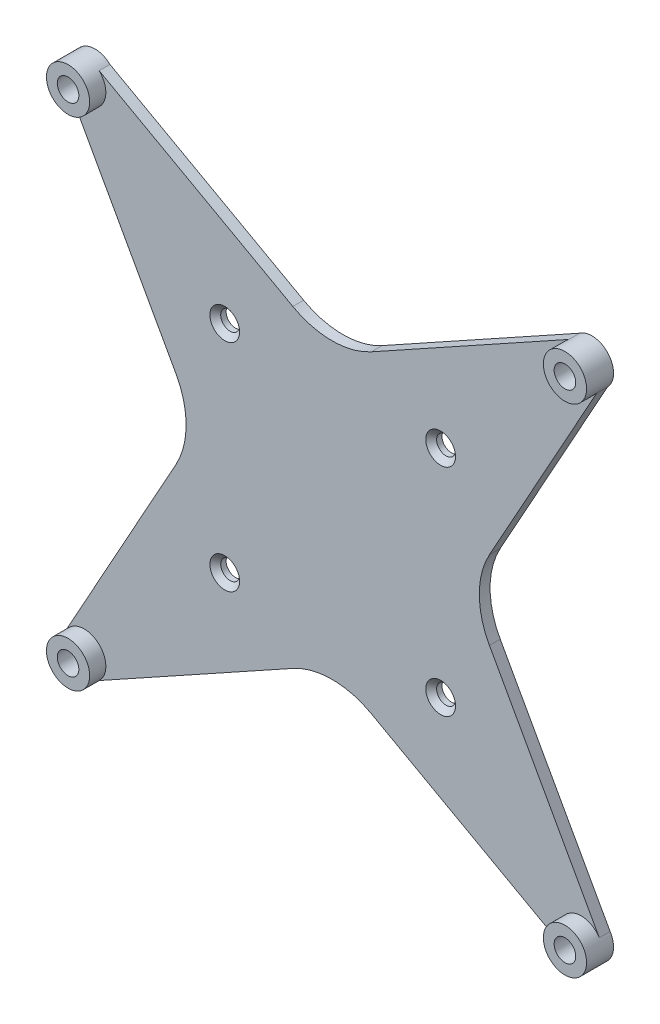
ISO-10303-21;
HEADER;
FILE_DESCRIPTION(('STEP AP214'),'2;1');
FILE_NAME('part.step','',(''),(''),'','','');
FILE_SCHEMA(('AUTOMOTIVE_DESIGN { 1 0 10303 214 1 1 1 1 }'));
ENDSEC;
DATA;
#1=APPLICATION_CONTEXT('core data for automotive mechanical design processes');
#2=APPLICATION_PROTOCOL_DEFINITION('international standard','automotive_design',2000,#1);
#3=PRODUCT_CONTEXT('',#1,'mechanical');
#4=PRODUCT('Part','Part','',(#3));
#5=PRODUCT_RELATED_PRODUCT_CATEGORY('part','',(#4));
#6=PRODUCT_DEFINITION_FORMATION('','',#4);
#7=PRODUCT_DEFINITION_CONTEXT('part definition',#1,'design');
#8=PRODUCT_DEFINITION('design','',#6,#7);
#9=PRODUCT_DEFINITION_SHAPE('','',#8);
#10=(LENGTH_UNIT() NAMED_UNIT(*) SI_UNIT(.MILLI.,.METRE.));
#11=(NAMED_UNIT(*) PLANE_ANGLE_UNIT() SI_UNIT($,.RADIAN.));
#12=(NAMED_UNIT(*) SI_UNIT($,.STERADIAN.) SOLID_ANGLE_UNIT());
#13=UNCERTAINTY_MEASURE_WITH_UNIT(LENGTH_MEASURE(1.E-05),#10,'distance_accuracy_value','');
#14=(GEOMETRIC_REPRESENTATION_CONTEXT(3) GLOBAL_UNCERTAINTY_ASSIGNED_CONTEXT((#13)) GLOBAL_UNIT_ASSIGNED_CONTEXT((#10,
#11,#12)) REPRESENTATION_CONTEXT('',''));
#15=CARTESIAN_POINT('',(0.,0.,0.));
#16=DIRECTION('',(0.,0.,1.));
#17=DIRECTION('',(1.,0.,0.));
#18=AXIS2_PLACEMENT_3D('',#15,#16,#17);
#19=CARTESIAN_POINT('',(136.15454301431,230.793193515127,178.407141652104));
#20=DIRECTION('',(0.,0.,1.));
#21=DIRECTION('',(1.,0.,0.));
#22=AXIS2_PLACEMENT_3D('',#19,#20,#21);
#23=CYLINDRICAL_SURFACE('',#22,2.00000381000801);
#24=CARTESIAN_POINT('',(136.15454301431,230.793193515127,183.407141652104));
#25=DIRECTION('',(0.,0.,-1.));
#26=DIRECTION('',(-1.,0.,0.));
#27=AXIS2_PLACEMENT_3D('',#24,#25,#26);
#28=CIRCLE('',#27,2.00000381000801);
#29=CARTESIAN_POINT('',(134.154539204302,230.793193515127,183.407141652104));
#30=VERTEX_POINT('',#29);
#31=EDGE_CURVE('E417',#30,#30,#28,.T.);
#32=ORIENTED_EDGE('',*,*,#31,.F.);
#33=EDGE_LOOP('',(#32));
#34=FACE_BOUND('',#33,.T.);
#35=CARTESIAN_POINT('',(136.15454301431,230.793193515127,180.407141652104));
#36=DIRECTION('',(0.,0.,-1.));
#37=DIRECTION('',(-1.,0.,0.));
#38=AXIS2_PLACEMENT_3D('',#35,#36,#37);
#39=CIRCLE('',#38,2.00000381000801);
#40=CARTESIAN_POINT('',(134.154539204302,230.793193515127,180.407141652104));
#41=VERTEX_POINT('',#40);
#42=EDGE_CURVE('E401',#41,#41,#39,.T.);
#43=ORIENTED_EDGE('',*,*,#42,.T.);
#44=EDGE_LOOP('',(#43));
#45=FACE_BOUND('',#44,.T.);
#46=ADVANCED_FACE('F35',(#34,#45),#23,.F.);
#47=CARTESIAN_POINT('',(136.15454301431,230.793193515127,178.407141652104));
#48=DIRECTION('',(0.,0.,-1.));
#49=DIRECTION('',(-1.,0.,0.));
#50=AXIS2_PLACEMENT_3D('',#47,#48,#49);
#51=PLANE('',#50);
#52=CARTESIAN_POINT('',(70.1670499993244,164.805700500142,178.407141652104));
#53=DIRECTION('',(0.,0.,-1.));
#54=DIRECTION('',(-1.,0.,0.));
#55=AXIS2_PLACEMENT_3D('',#52,#53,#54);
#56=CIRCLE('',#55,1.75);
#57=CARTESIAN_POINT('',(68.4170499993244,164.805700500142,178.407141652104));
#58=VERTEX_POINT('',#57);
#59=EDGE_CURVE('E327',#58,#58,#56,.F.);
#60=ORIENTED_EDGE('',*,*,#59,.T.);
#61=EDGE_LOOP('',(#60));
#62=FACE_BOUND('',#61,.T.);
#63=CARTESIAN_POINT('',(110.141850608925,164.805700500142,178.407141652104));
#64=DIRECTION('',(0.,0.,-1.));
#65=DIRECTION('',(-1.,0.,0.));
#66=AXIS2_PLACEMENT_3D('',#63,#64,#65);
#67=CIRCLE('',#66,1.75);
#68=CARTESIAN_POINT('',(108.391850608925,164.805700500142,178.407141652104));
#69=VERTEX_POINT('',#68);
#70=EDGE_CURVE('E324',#69,#69,#67,.F.);
#71=ORIENTED_EDGE('',*,*,#70,.T.);
#72=EDGE_LOOP('',(#71));
#73=FACE_BOUND('',#72,.T.);
#74=CARTESIAN_POINT('',(110.141850608925,204.780501109742,178.407141652104));
#75=DIRECTION('',(0.,0.,-1.));
#76=DIRECTION('',(-1.,0.,0.));
#77=AXIS2_PLACEMENT_3D('',#74,#75,#76);
#78=CIRCLE('',#77,1.75);
#79=CARTESIAN_POINT('',(108.391850608925,204.780501109742,178.407141652104));
#80=VERTEX_POINT('',#79);
#81=EDGE_CURVE('E326',#80,#80,#78,.F.);
#82=ORIENTED_EDGE('',*,*,#81,.T.);
#83=EDGE_LOOP('',(#82));
#84=FACE_BOUND('',#83,.T.);
#85=CARTESIAN_POINT('',(70.1670499993244,204.780501109742,178.407141652104));
#86=DIRECTION('',(0.,0.,-1.));
#87=DIRECTION('',(-1.,0.,0.));
#88=AXIS2_PLACEMENT_3D('',#85,#86,#87);
#89=CIRCLE('',#88,1.75);
#90=CARTESIAN_POINT('',(68.4170499993244,204.780501109742,178.407141652104));
#91=VERTEX_POINT('',#90);
#92=EDGE_CURVE('E330',#91,#91,#89,.F.);
#93=ORIENTED_EDGE('',*,*,#92,.T.);
#94=EDGE_LOOP('',(#93));
#95=FACE_BOUND('',#94,.T.);
#96=DIRECTION('',(-0.484809620246339,-0.874619707139395,0.));
#97=VECTOR('',#96,1.);
#98=CARTESIAN_POINT('',(139.007032023109,227.98903473669,178.407141652104));
#99=LINE('',#98,#97);
#100=CARTESIAN_POINT('',(139.007032023109,227.98903473669,178.407141652104));
#101=VERTEX_POINT('',#100);
#102=CARTESIAN_POINT('',(119.172866019934,192.207252080982,178.407141652104));
#103=VERTEX_POINT('',#102);
#104=EDGE_CURVE('E374',#101,#103,#99,.T.);
#105=ORIENTED_EDGE('',*,*,#104,.T.);
#106=CARTESIAN_POINT('',(132.292161627025,184.935107777287,178.407141652104));
#107=DIRECTION('',(0.,0.,-1.));
#108=DIRECTION('',(-1.,0.,0.));
#109=AXIS2_PLACEMENT_3D('',#106,#107,#108);
#110=CIRCLE('',#109,15.);
#111=CARTESIAN_POINT('',(119.172866019934,177.662963473592,178.407141652104));
#112=VERTEX_POINT('',#111);
#113=EDGE_CURVE('E59',#103,#112,#110,.F.);
#114=ORIENTED_EDGE('',*,*,#113,.T.);
#115=DIRECTION('',(0.484809620246338,-0.874619707139395,0.));
#116=VECTOR('',#115,1.);
#117=CARTESIAN_POINT('',(115.141850608925,184.935107777287,178.407141652104));
#118=LINE('',#117,#116);
#119=CARTESIAN_POINT('',(139.523599689283,140.949268079277,178.407141652104));
#120=VERTEX_POINT('',#119);
#121=EDGE_CURVE('E376',#112,#120,#118,.T.);
#122=ORIENTED_EDGE('',*,*,#121,.T.);
#123=CARTESIAN_POINT('',(136.15454301431,138.793008094762,178.407141652104));
#124=DIRECTION('',(0.,0.,-1.));
#125=DIRECTION('',(-1.,0.,0.));
#126=AXIS2_PLACEMENT_3D('',#123,#124,#125);
#127=CIRCLE('',#126,4.00000000000001);
#128=CARTESIAN_POINT('',(133.857043765656,135.518638353509,178.407141652104));
#129=VERTEX_POINT('',#128);
#130=EDGE_CURVE('E378',#120,#129,#127,.T.);
#131=ORIENTED_EDGE('',*,*,#130,.T.);
#132=DIRECTION('',(-0.874619707139395,0.484809620246338,0.));
#133=VECTOR('',#132,1.);
#134=CARTESIAN_POINT('',(133.857043765656,135.518638353509,178.407141652104));
#135=LINE('',#134,#133);
#136=CARTESIAN_POINT('',(97.3141681215805,155.774685089133,178.407141652104));
#137=VERTEX_POINT('',#136);
#138=EDGE_CURVE('E168',#129,#137,#135,.T.);
#139=ORIENTED_EDGE('',*,*,#138,.T.);
#140=CARTESIAN_POINT('',(90.0420238178855,142.655389482042,178.407141652104));
#141=DIRECTION('',(0.,0.,-1.));
#142=DIRECTION('',(-1.,0.,0.));
#143=AXIS2_PLACEMENT_3D('',#140,#141,#142);
#144=CIRCLE('',#143,15.);
#145=CARTESIAN_POINT('',(82.7698795141904,155.774685089133,178.407141652104));
#146=VERTEX_POINT('',#145);
#147=EDGE_CURVE('E203',#137,#146,#144,.F.);
#148=ORIENTED_EDGE('',*,*,#147,.T.);
#149=DIRECTION('',(-0.874619707139396,-0.484809620246338,0.));
#150=VECTOR('',#149,1.);
#151=CARTESIAN_POINT('',(90.0420238178855,159.805700500142,178.407141652104));
#152=LINE('',#151,#150);
#153=CARTESIAN_POINT('',(46.9190367426645,135.902238438666,178.407141652104));
#154=VERTEX_POINT('',#153);
#155=EDGE_CURVE('E381',#146,#154,#152,.T.);
#156=ORIENTED_EDGE('',*,*,#155,.T.);
#157=CARTESIAN_POINT('',(44.1543575939393,138.793008094762,178.407141652104));
#158=DIRECTION('',(0.,0.,-1.));
#159=DIRECTION('',(-1.,0.,0.));
#160=AXIS2_PLACEMENT_3D('',#157,#158,#159);
#161=CIRCLE('',#160,4.);
#162=CARTESIAN_POINT('',(40.7853009189664,140.949268079277,178.407141652104));
#163=VERTEX_POINT('',#162);
#164=EDGE_CURVE('E383',#154,#163,#161,.T.);
#165=ORIENTED_EDGE('',*,*,#164,.T.);
#166=DIRECTION('',(0.484809620246339,0.874619707139395,0.));
#167=VECTOR('',#166,1.);
#168=CARTESIAN_POINT('',(40.7853009189664,140.949268079277,178.407141652104));
#169=LINE('',#168,#167);
#170=CARTESIAN_POINT('',(61.1360345883155,177.662963473592,178.407141652104));
#171=VERTEX_POINT('',#170);
#172=EDGE_CURVE('E386',#163,#171,#169,.T.);
#173=ORIENTED_EDGE('',*,*,#172,.T.);
#174=CARTESIAN_POINT('',(48.0167389812246,184.935107777287,178.407141652104));
#175=DIRECTION('',(0.,0.,-1.));
#176=DIRECTION('',(-1.,0.,0.));
#177=AXIS2_PLACEMENT_3D('',#174,#175,#176);
#178=CIRCLE('',#177,15.);
#179=CARTESIAN_POINT('',(61.1360345883155,192.207252080982,178.407141652104));
#180=VERTEX_POINT('',#179);
#181=EDGE_CURVE('E210',#171,#180,#178,.F.);
#182=ORIENTED_EDGE('',*,*,#181,.T.);
#183=DIRECTION('',(-0.484809620246338,0.874619707139395,0.));
#184=VECTOR('',#183,1.);
#185=CARTESIAN_POINT('',(65.1670499993244,184.935107777287,178.407141652104));
#186=LINE('',#185,#184);
#187=CARTESIAN_POINT('',(41.3018685851414,227.989034736689,178.407141652104));
#188=VERTEX_POINT('',#187);
#189=EDGE_CURVE('E389',#180,#188,#186,.T.);
#190=ORIENTED_EDGE('',*,*,#189,.T.);
#191=CARTESIAN_POINT('',(44.1543575939393,230.793193515127,178.407141652104));
#192=DIRECTION('',(0.,0.,-1.));
#193=DIRECTION('',(-1.,0.,0.));
#194=AXIS2_PLACEMENT_3D('',#191,#192,#193);
#195=CIRCLE('',#194,3.99999999999999);
#196=CARTESIAN_POINT('',(46.9190367426769,233.683963171211,178.407141652104));
#197=VERTEX_POINT('',#196);
#198=EDGE_CURVE('E391',#188,#197,#195,.T.);
#199=ORIENTED_EDGE('',*,*,#198,.T.);
#200=DIRECTION('',(0.874619707139395,-0.484809620246339,0.));
#201=VECTOR('',#200,1.);
#202=CARTESIAN_POINT('',(46.9190367426769,233.683963171211,178.407141652104));
#203=LINE('',#202,#201);
#204=CARTESIAN_POINT('',(82.7698795141904,213.81151652075,178.407141652104));
#205=VERTEX_POINT('',#204);
#206=EDGE_CURVE('E394',#197,#205,#203,.T.);
#207=ORIENTED_EDGE('',*,*,#206,.T.);
#208=CARTESIAN_POINT('',(90.0420238178855,226.930812127841,178.407141652104));
#209=DIRECTION('',(0.,0.,-1.));
#210=DIRECTION('',(-1.,0.,0.));
#211=AXIS2_PLACEMENT_3D('',#208,#209,#210);
#212=CIRCLE('',#211,15.);
#213=CARTESIAN_POINT('',(97.3141681215806,213.81151652075,178.407141652104));
#214=VERTEX_POINT('',#213);
#215=EDGE_CURVE('E206',#205,#214,#212,.F.);
#216=ORIENTED_EDGE('',*,*,#215,.T.);
#217=DIRECTION('',(0.874619707139395,0.484809620246338,0.));
#218=VECTOR('',#217,1.);
#219=CARTESIAN_POINT('',(90.0420238178855,209.780501109742,178.407141652104));
#220=LINE('',#219,#218);
#221=CARTESIAN_POINT('',(133.857043765622,234.067563256355,178.407141652104));
#222=VERTEX_POINT('',#221);
#223=EDGE_CURVE('E360',#214,#222,#220,.T.);
#224=ORIENTED_EDGE('',*,*,#223,.T.);
#225=CARTESIAN_POINT('',(136.15454301431,230.793193515127,178.407141652104));
#226=DIRECTION('',(0.,0.,-1.));
#227=DIRECTION('',(-1.,0.,0.));
#228=AXIS2_PLACEMENT_3D('',#225,#226,#227);
#229=CIRCLE('',#228,3.99999999999999);
#230=EDGE_CURVE('E421',#222,#101,#229,.T.);
#231=ORIENTED_EDGE('',*,*,#230,.T.);
#232=EDGE_LOOP('',(#105,#114,#122,#131,#139,#148,#156,#165,#173,#182,#190,#199,#207,#216,#224,#231));
#233=FACE_BOUND('',#232,.T.);
#234=ADVANCED_FACE('F255',(#62,#73,#84,#95,#233),#51,.T.);
#235=CARTESIAN_POINT('',(136.15454301431,230.793193515127,183.407141652104));
#236=DIRECTION('',(0.,0.,-1.));
#237=DIRECTION('',(-1.,0.,0.));
#238=AXIS2_PLACEMENT_3D('',#235,#236,#237);
#239=PLANE('',#238);
#240=CARTESIAN_POINT('',(136.15454301431,230.793193515127,183.407141652104));
#241=DIRECTION('',(0.,0.,-1.));
#242=DIRECTION('',(-1.,0.,0.));
#243=AXIS2_PLACEMENT_3D('',#240,#241,#242);
#244=CIRCLE('',#243,3.99999999999999);
#245=CARTESIAN_POINT('',(132.15454301431,230.793193515127,183.407141652104));
#246=VERTEX_POINT('',#245);
#247=EDGE_CURVE('E420',#246,#246,#244,.T.);
#248=ORIENTED_EDGE('',*,*,#247,.F.);
#249=EDGE_LOOP('',(#248));
#250=FACE_BOUND('',#249,.T.);
#251=ORIENTED_EDGE('',*,*,#31,.T.);
#252=EDGE_LOOP('',(#251));
#253=FACE_BOUND('',#252,.T.);
#254=ADVANCED_FACE('F261',(#250,#253),#239,.F.);
#255=CARTESIAN_POINT('',(136.15454301431,230.793193515127,178.407141652104));
#256=DIRECTION('',(0.,0.,1.));
#257=DIRECTION('',(1.,0.,0.));
#258=AXIS2_PLACEMENT_3D('',#255,#256,#257);
#259=CYLINDRICAL_SURFACE('',#258,3.99999999999999);
#260=ORIENTED_EDGE('',*,*,#230,.F.);
#261=DIRECTION('',(0.,0.,-1.));
#262=VECTOR('',#261,1.);
#263=CARTESIAN_POINT('',(133.857043765622,234.067563256355,180.407141652104));
#264=LINE('',#263,#262);
#265=CARTESIAN_POINT('',(133.857043765622,234.067563256355,180.407141652104));
#266=VERTEX_POINT('',#265);
#267=EDGE_CURVE('E398',#266,#222,#264,.T.);
#268=ORIENTED_EDGE('',*,*,#267,.F.);
#269=CARTESIAN_POINT('',(136.15454301431,230.793193515127,180.407141652104));
#270=DIRECTION('',(0.,0.,-1.));
#271=DIRECTION('',(-1.,0.,0.));
#272=AXIS2_PLACEMENT_3D('',#269,#270,#271);
#273=CIRCLE('',#272,3.99999999999999);
#274=CARTESIAN_POINT('',(139.007032023109,227.98903473669,180.407141652104));
#275=VERTEX_POINT('',#274);
#276=EDGE_CURVE('E414',#275,#266,#273,.T.);
#277=ORIENTED_EDGE('',*,*,#276,.F.);
#278=DIRECTION('',(0.,0.,-1.));
#279=VECTOR('',#278,1.);
#280=CARTESIAN_POINT('',(139.007032023109,227.98903473669,180.407141652104));
#281=LINE('',#280,#279);
#282=EDGE_CURVE('E373',#275,#101,#281,.T.);
#283=ORIENTED_EDGE('',*,*,#282,.T.);
#284=EDGE_LOOP('',(#260,#268,#277,#283));
#285=FACE_BOUND('',#284,.T.);
#286=ORIENTED_EDGE('',*,*,#247,.T.);
#287=EDGE_LOOP('',(#286));
#288=FACE_BOUND('',#287,.T.);
#289=ADVANCED_FACE('F272',(#285,#288),#259,.T.);
#290=CARTESIAN_POINT('',(136.15454301431,230.793193515127,180.407141652104));
#291=DIRECTION('',(0.,0.,-1.));
#292=DIRECTION('',(-1.,0.,0.));
#293=AXIS2_PLACEMENT_3D('',#290,#291,#292);
#294=PLANE('',#293);
#295=ORIENTED_EDGE('',*,*,#42,.F.);
#296=EDGE_LOOP('',(#295));
#297=FACE_BOUND('',#296,.T.);
#298=ADVANCED_FACE('F276',(#297),#294,.F.);
#299=CARTESIAN_POINT('',(90.0420238178855,209.780501109742,180.407141652104));
#300=DIRECTION('',(-0.484809620246338,0.874619707139395,0.));
#301=DIRECTION('',(-0.874619707139396,-0.484809620246338,0.));
#302=AXIS2_PLACEMENT_3D('',#299,#300,#301);
#303=PLANE('',#302);
#304=ORIENTED_EDGE('',*,*,#223,.F.);
#305=DIRECTION('',(0.,0.,-1.));
#306=VECTOR('',#305,1.);
#307=CARTESIAN_POINT('',(97.3141681215806,213.81151652075,180.407141652104));
#308=LINE('',#307,#306);
#309=CARTESIAN_POINT('',(97.3141681215806,213.81151652075,180.407141652104));
#310=VERTEX_POINT('',#309);
#311=EDGE_CURVE('E192',#214,#310,#308,.F.);
#312=ORIENTED_EDGE('',*,*,#311,.T.);
#313=DIRECTION('',(0.874619707139395,0.484809620246338,0.));
#314=VECTOR('',#313,1.);
#315=CARTESIAN_POINT('',(90.0420238178855,209.780501109742,180.407141652104));
#316=LINE('',#315,#314);
#317=EDGE_CURVE('E371',#310,#266,#316,.T.);
#318=ORIENTED_EDGE('',*,*,#317,.T.);
#319=ORIENTED_EDGE('',*,*,#267,.T.);
#320=EDGE_LOOP('',(#304,#312,#318,#319));
#321=FACE_BOUND('',#320,.T.);
#322=ADVANCED_FACE('F465',(#321),#303,.T.);
#323=CARTESIAN_POINT('',(46.9190367426769,233.683963171211,180.407141652104));
#324=DIRECTION('',(0.484809620246339,0.874619707139395,0.));
#325=DIRECTION('',(-0.874619707139395,0.484809620246339,0.));
#326=AXIS2_PLACEMENT_3D('',#323,#324,#325);
#327=PLANE('',#326);
#328=DIRECTION('',(0.874619707139395,-0.484809620246339,0.));
#329=VECTOR('',#328,1.);
#330=CARTESIAN_POINT('',(46.9190367426769,233.683963171211,180.407141652104));
#331=LINE('',#330,#329);
#332=CARTESIAN_POINT('',(46.9190367426769,233.683963171211,180.407141652104));
#333=VERTEX_POINT('',#332);
#334=CARTESIAN_POINT('',(82.7698795141904,213.81151652075,180.407141652104));
#335=VERTEX_POINT('',#334);
#336=EDGE_CURVE('E368',#333,#335,#331,.T.);
#337=ORIENTED_EDGE('',*,*,#336,.T.);
#338=DIRECTION('',(0.,0.,-1.));
#339=VECTOR('',#338,1.);
#340=CARTESIAN_POINT('',(82.7698795141904,213.81151652075,178.407141652104));
#341=LINE('',#340,#339);
#342=EDGE_CURVE('E189',#335,#205,#341,.T.);
#343=ORIENTED_EDGE('',*,*,#342,.T.);
#344=ORIENTED_EDGE('',*,*,#206,.F.);
#345=DIRECTION('',(0.,0.,-1.));
#346=VECTOR('',#345,1.);
#347=CARTESIAN_POINT('',(46.9190367426769,233.683963171211,180.407141652104));
#348=LINE('',#347,#346);
#349=EDGE_CURVE('E402',#333,#197,#348,.T.);
#350=ORIENTED_EDGE('',*,*,#349,.F.);
#351=EDGE_LOOP('',(#337,#343,#344,#350));
#352=FACE_BOUND('',#351,.T.);
#353=ADVANCED_FACE('F468',(#352),#327,.T.);
#354=CARTESIAN_POINT('',(44.1543575939393,230.793193515127,180.407141652104));
#355=DIRECTION('',(0.,0.,-1.));
#356=DIRECTION('',(-1.,0.,0.));
#357=AXIS2_PLACEMENT_3D('',#354,#355,#356);
#358=CYLINDRICAL_SURFACE('',#357,3.99999999999999);
#359=ORIENTED_EDGE('',*,*,#198,.F.);
#360=DIRECTION('',(0.,0.,-1.));
#361=VECTOR('',#360,1.);
#362=CARTESIAN_POINT('',(41.3018685851414,227.989034736689,180.407141652104));
#363=LINE('',#362,#361);
#364=CARTESIAN_POINT('',(41.3018685851414,227.989034736689,180.407141652104));
#365=VERTEX_POINT('',#364);
#366=EDGE_CURVE('E404',#365,#188,#363,.T.);
#367=ORIENTED_EDGE('',*,*,#366,.F.);
#368=CARTESIAN_POINT('',(44.1543575939393,230.793193515127,180.407141652104));
#369=DIRECTION('',(0.,0.,-1.));
#370=DIRECTION('',(-1.,0.,0.));
#371=AXIS2_PLACEMENT_3D('',#368,#369,#370);
#372=CIRCLE('',#371,4.);
#373=EDGE_CURVE('E183',#365,#333,#372,.F.);
#374=ORIENTED_EDGE('',*,*,#373,.T.);
#375=ORIENTED_EDGE('',*,*,#349,.T.);
#376=EDGE_LOOP('',(#359,#367,#374,#375));
#377=FACE_BOUND('',#376,.T.);
#378=CARTESIAN_POINT('',(44.1543575939393,230.793193515127,183.407141652104));
#379=DIRECTION('',(0.,0.,-1.));
#380=DIRECTION('',(-1.,0.,0.));
#381=AXIS2_PLACEMENT_3D('',#378,#379,#380);
#382=CIRCLE('',#381,4.);
#383=CARTESIAN_POINT('',(40.1543575939393,230.793193515127,183.407141652104));
#384=VERTEX_POINT('',#383);
#385=EDGE_CURVE('E353',#384,#384,#382,.T.);
#386=ORIENTED_EDGE('',*,*,#385,.T.);
#387=EDGE_LOOP('',(#386));
#388=FACE_BOUND('',#387,.T.);
#389=ADVANCED_FACE('F472',(#377,#388),#358,.T.);
#390=CARTESIAN_POINT('',(65.1670499993244,184.935107777287,180.407141652104));
#391=DIRECTION('',(-0.874619707139396,-0.484809620246338,0.));
#392=DIRECTION('',(0.484809620246338,-0.874619707139395,0.));
#393=AXIS2_PLACEMENT_3D('',#390,#391,#392);
#394=PLANE('',#393);
#395=ORIENTED_EDGE('',*,*,#189,.F.);
#396=DIRECTION('',(0.,0.,-1.));
#397=VECTOR('',#396,1.);
#398=CARTESIAN_POINT('',(61.1360345883155,192.207252080982,180.407141652104));
#399=LINE('',#398,#397);
#400=CARTESIAN_POINT('',(61.1360345883155,192.207252080982,180.407141652104));
#401=VERTEX_POINT('',#400);
#402=EDGE_CURVE('E197',#180,#401,#399,.F.);
#403=ORIENTED_EDGE('',*,*,#402,.T.);
#404=DIRECTION('',(-0.484809620246338,0.874619707139395,0.));
#405=VECTOR('',#404,1.);
#406=CARTESIAN_POINT('',(65.1670499993244,184.935107777287,180.407141652104));
#407=LINE('',#406,#405);
#408=EDGE_CURVE('E366',#401,#365,#407,.T.);
#409=ORIENTED_EDGE('',*,*,#408,.T.);
#410=ORIENTED_EDGE('',*,*,#366,.T.);
#411=EDGE_LOOP('',(#395,#403,#409,#410));
#412=FACE_BOUND('',#411,.T.);
#413=ADVANCED_FACE('F476',(#412),#394,.T.);
#414=CARTESIAN_POINT('',(40.7853009189664,140.949268079277,180.407141652104));
#415=DIRECTION('',(-0.874619707139395,0.484809620246339,0.));
#416=DIRECTION('',(-0.484809620246339,-0.874619707139395,0.));
#417=AXIS2_PLACEMENT_3D('',#414,#415,#416);
#418=PLANE('',#417);
#419=DIRECTION('',(0.484809620246339,0.874619707139395,0.));
#420=VECTOR('',#419,1.);
#421=CARTESIAN_POINT('',(40.7853009189664,140.949268079277,180.407141652104));
#422=LINE('',#421,#420);
#423=CARTESIAN_POINT('',(40.7853009189664,140.949268079277,180.407141652104));
#424=VERTEX_POINT('',#423);
#425=CARTESIAN_POINT('',(61.1360345883155,177.662963473592,180.407141652104));
#426=VERTEX_POINT('',#425);
#427=EDGE_CURVE('E363',#424,#426,#422,.T.);
#428=ORIENTED_EDGE('',*,*,#427,.T.);
#429=DIRECTION('',(0.,0.,-1.));
#430=VECTOR('',#429,1.);
#431=CARTESIAN_POINT('',(61.1360345883155,177.662963473592,178.407141652104));
#432=LINE('',#431,#430);
#433=EDGE_CURVE('E194',#426,#171,#432,.T.);
#434=ORIENTED_EDGE('',*,*,#433,.T.);
#435=ORIENTED_EDGE('',*,*,#172,.F.);
#436=DIRECTION('',(0.,0.,-1.));
#437=VECTOR('',#436,1.);
#438=CARTESIAN_POINT('',(40.7853009189664,140.949268079277,180.407141652104));
#439=LINE('',#438,#437);
#440=EDGE_CURVE('E407',#424,#163,#439,.T.);
#441=ORIENTED_EDGE('',*,*,#440,.F.);
#442=EDGE_LOOP('',(#428,#434,#435,#441));
#443=FACE_BOUND('',#442,.T.);
#444=ADVANCED_FACE('F480',(#443),#418,.T.);
#445=CARTESIAN_POINT('',(44.1543575939393,138.793008094762,180.407141652104));
#446=DIRECTION('',(0.,0.,-1.));
#447=DIRECTION('',(-1.,0.,0.));
#448=AXIS2_PLACEMENT_3D('',#445,#446,#447);
#449=CYLINDRICAL_SURFACE('',#448,4.);
#450=ORIENTED_EDGE('',*,*,#164,.F.);
#451=DIRECTION('',(0.,0.,-1.));
#452=VECTOR('',#451,1.);
#453=CARTESIAN_POINT('',(46.9190367426645,135.902238438666,180.407141652104));
#454=LINE('',#453,#452);
#455=CARTESIAN_POINT('',(46.9190367426645,135.902238438666,180.407141652104));
#456=VERTEX_POINT('',#455);
#457=EDGE_CURVE('E172',#456,#154,#454,.T.);
#458=ORIENTED_EDGE('',*,*,#457,.F.);
#459=CARTESIAN_POINT('',(44.1543575939393,138.793008094762,180.407141652104));
#460=DIRECTION('',(0.,0.,-1.));
#461=DIRECTION('',(-1.,0.,0.));
#462=AXIS2_PLACEMENT_3D('',#459,#460,#461);
#463=CIRCLE('',#462,4.);
#464=EDGE_CURVE('E179',#456,#424,#463,.F.);
#465=ORIENTED_EDGE('',*,*,#464,.T.);
#466=ORIENTED_EDGE('',*,*,#440,.T.);
#467=EDGE_LOOP('',(#450,#458,#465,#466));
#468=FACE_BOUND('',#467,.T.);
#469=CARTESIAN_POINT('',(44.1543575939393,138.793008094762,183.407141652104));
#470=DIRECTION('',(0.,0.,-1.));
#471=DIRECTION('',(-1.,0.,0.));
#472=AXIS2_PLACEMENT_3D('',#469,#470,#471);
#473=CIRCLE('',#472,4.);
#474=CARTESIAN_POINT('',(40.1543575939393,138.793008094762,183.407141652104));
#475=VERTEX_POINT('',#474);
#476=EDGE_CURVE('E346',#475,#475,#473,.T.);
#477=ORIENTED_EDGE('',*,*,#476,.T.);
#478=EDGE_LOOP('',(#477));
#479=FACE_BOUND('',#478,.T.);
#480=ADVANCED_FACE('F484',(#468,#479),#449,.T.);
#481=CARTESIAN_POINT('',(90.0420238178855,159.805700500142,180.407141652104));
#482=DIRECTION('',(0.484809620246338,-0.874619707139396,0.));
#483=DIRECTION('',(0.874619707139396,0.484809620246338,0.));
#484=AXIS2_PLACEMENT_3D('',#481,#482,#483);
#485=PLANE('',#484);
#486=ORIENTED_EDGE('',*,*,#155,.F.);
#487=DIRECTION('',(0.,0.,-1.));
#488=VECTOR('',#487,1.);
#489=CARTESIAN_POINT('',(82.7698795141904,155.774685089133,180.407141652104));
#490=LINE('',#489,#488);
#491=CARTESIAN_POINT('',(82.7698795141904,155.774685089133,180.407141652104));
#492=VERTEX_POINT('',#491);
#493=EDGE_CURVE('E181',#146,#492,#490,.F.);
#494=ORIENTED_EDGE('',*,*,#493,.T.);
#495=DIRECTION('',(-0.874619707139396,-0.484809620246338,0.));
#496=VECTOR('',#495,1.);
#497=CARTESIAN_POINT('',(90.0420238178855,159.805700500142,180.407141652104));
#498=LINE('',#497,#496);
#499=EDGE_CURVE('E161',#492,#456,#498,.T.);
#500=ORIENTED_EDGE('',*,*,#499,.T.);
#501=ORIENTED_EDGE('',*,*,#457,.T.);
#502=EDGE_LOOP('',(#486,#494,#500,#501));
#503=FACE_BOUND('',#502,.T.);
#504=ADVANCED_FACE('F488',(#503),#485,.T.);
#505=CARTESIAN_POINT('',(133.857043765656,135.518638353509,180.407141652104));
#506=DIRECTION('',(-0.484809620246338,-0.874619707139395,0.));
#507=DIRECTION('',(0.874619707139395,-0.484809620246338,0.));
#508=AXIS2_PLACEMENT_3D('',#505,#506,#507);
#509=PLANE('',#508);
#510=DIRECTION('',(-0.874619707139395,0.484809620246338,0.));
#511=VECTOR('',#510,1.);
#512=CARTESIAN_POINT('',(133.857043765656,135.518638353509,180.407141652104));
#513=LINE('',#512,#511);
#514=CARTESIAN_POINT('',(133.857043765656,135.518638353509,180.407141652104));
#515=VERTEX_POINT('',#514);
#516=CARTESIAN_POINT('',(97.3141681215805,155.774685089133,180.407141652104));
#517=VERTEX_POINT('',#516);
#518=EDGE_CURVE('E149',#515,#517,#513,.T.);
#519=ORIENTED_EDGE('',*,*,#518,.T.);
#520=DIRECTION('',(0.,0.,-1.));
#521=VECTOR('',#520,1.);
#522=CARTESIAN_POINT('',(97.3141681215805,155.774685089133,178.407141652104));
#523=LINE('',#522,#521);
#524=EDGE_CURVE('E178',#517,#137,#523,.T.);
#525=ORIENTED_EDGE('',*,*,#524,.T.);
#526=ORIENTED_EDGE('',*,*,#138,.F.);
#527=DIRECTION('',(0.,0.,-1.));
#528=VECTOR('',#527,1.);
#529=CARTESIAN_POINT('',(133.857043765656,135.518638353509,180.407141652104));
#530=LINE('',#529,#528);
#531=EDGE_CURVE('E165',#515,#129,#530,.T.);
#532=ORIENTED_EDGE('',*,*,#531,.F.);
#533=EDGE_LOOP('',(#519,#525,#526,#532));
#534=FACE_BOUND('',#533,.T.);
#535=ADVANCED_FACE('F166',(#534),#509,.T.);
#536=CARTESIAN_POINT('',(136.15454301431,138.793008094762,180.407141652104));
#537=DIRECTION('',(0.,0.,-1.));
#538=DIRECTION('',(-1.,0.,0.));
#539=AXIS2_PLACEMENT_3D('',#536,#537,#538);
#540=CYLINDRICAL_SURFACE('',#539,4.00000000000001);
#541=ORIENTED_EDGE('',*,*,#130,.F.);
#542=DIRECTION('',(0.,0.,-1.));
#543=VECTOR('',#542,1.);
#544=CARTESIAN_POINT('',(139.523599689283,140.949268079277,180.407141652104));
#545=LINE('',#544,#543);
#546=CARTESIAN_POINT('',(139.523599689283,140.949268079277,180.407141652104));
#547=VERTEX_POINT('',#546);
#548=EDGE_CURVE('E173',#547,#120,#545,.T.);
#549=ORIENTED_EDGE('',*,*,#548,.F.);
#550=CARTESIAN_POINT('',(136.15454301431,138.793008094762,180.407141652104));
#551=DIRECTION('',(0.,0.,-1.));
#552=DIRECTION('',(-1.,0.,0.));
#553=AXIS2_PLACEMENT_3D('',#550,#551,#552);
#554=CIRCLE('',#553,3.99999999999999);
#555=EDGE_CURVE('E153',#547,#515,#554,.F.);
#556=ORIENTED_EDGE('',*,*,#555,.T.);
#557=ORIENTED_EDGE('',*,*,#531,.T.);
#558=EDGE_LOOP('',(#541,#549,#556,#557));
#559=FACE_BOUND('',#558,.T.);
#560=CARTESIAN_POINT('',(136.15454301431,138.793008094762,183.407141652104));
#561=DIRECTION('',(0.,0.,-1.));
#562=DIRECTION('',(-1.,0.,0.));
#563=AXIS2_PLACEMENT_3D('',#560,#561,#562);
#564=CIRCLE('',#563,3.99999999999999);
#565=CARTESIAN_POINT('',(132.15454301431,138.793008094762,183.407141652104));
#566=VERTEX_POINT('',#565);
#567=EDGE_CURVE('E340',#566,#566,#564,.T.);
#568=ORIENTED_EDGE('',*,*,#567,.T.);
#569=EDGE_LOOP('',(#568));
#570=FACE_BOUND('',#569,.T.);
#571=ADVANCED_FACE('F175',(#559,#570),#540,.T.);
#572=CARTESIAN_POINT('',(115.141850608925,184.935107777287,180.407141652104));
#573=DIRECTION('',(0.874619707139396,0.484809620246338,0.));
#574=DIRECTION('',(-0.484809620246338,0.874619707139396,0.));
#575=AXIS2_PLACEMENT_3D('',#572,#573,#574);
#576=PLANE('',#575);
#577=ORIENTED_EDGE('',*,*,#121,.F.);
#578=DIRECTION('',(0.,0.,-1.));
#579=VECTOR('',#578,1.);
#580=CARTESIAN_POINT('',(119.172866019934,177.662963473592,180.407141652104));
#581=LINE('',#580,#579);
#582=CARTESIAN_POINT('',(119.172866019934,177.662963473592,180.407141652104));
#583=VERTEX_POINT('',#582);
#584=EDGE_CURVE('E51',#112,#583,#581,.F.);
#585=ORIENTED_EDGE('',*,*,#584,.T.);
#586=DIRECTION('',(0.484809620246338,-0.874619707139395,0.));
#587=VECTOR('',#586,1.);
#588=CARTESIAN_POINT('',(115.141850608925,184.935107777287,180.407141652104));
#589=LINE('',#588,#587);
#590=EDGE_CURVE('E162',#583,#547,#589,.T.);
#591=ORIENTED_EDGE('',*,*,#590,.T.);
#592=ORIENTED_EDGE('',*,*,#548,.T.);
#593=EDGE_LOOP('',(#577,#585,#591,#592));
#594=FACE_BOUND('',#593,.T.);
#595=ADVANCED_FACE('F496',(#594),#576,.T.);
#596=CARTESIAN_POINT('',(139.007032023109,227.98903473669,180.407141652104));
#597=DIRECTION('',(0.874619707139395,-0.484809620246339,0.));
#598=DIRECTION('',(0.484809620246339,0.874619707139395,0.));
#599=AXIS2_PLACEMENT_3D('',#596,#597,#598);
#600=PLANE('',#599);
#601=DIRECTION('',(-0.484809620246339,-0.874619707139395,0.));
#602=VECTOR('',#601,1.);
#603=CARTESIAN_POINT('',(139.007032023109,227.98903473669,180.407141652104));
#604=LINE('',#603,#602);
#605=CARTESIAN_POINT('',(119.172866019934,192.207252080982,180.407141652104));
#606=VERTEX_POINT('',#605);
#607=EDGE_CURVE('E357',#275,#606,#604,.T.);
#608=ORIENTED_EDGE('',*,*,#607,.T.);
#609=DIRECTION('',(0.,0.,-1.));
#610=VECTOR('',#609,1.);
#611=CARTESIAN_POINT('',(119.172866019934,192.207252080982,178.407141652104));
#612=LINE('',#611,#610);
#613=EDGE_CURVE('E199',#606,#103,#612,.T.);
#614=ORIENTED_EDGE('',*,*,#613,.T.);
#615=ORIENTED_EDGE('',*,*,#104,.F.);
#616=ORIENTED_EDGE('',*,*,#282,.F.);
#617=EDGE_LOOP('',(#608,#614,#615,#616));
#618=FACE_BOUND('',#617,.T.);
#619=ADVANCED_FACE('F267',(#618),#600,.T.);
#620=CARTESIAN_POINT('',(110.141850608925,164.805700500142,180.407141652104));
#621=DIRECTION('',(0.,0.,-1.));
#622=DIRECTION('',(-1.,0.,0.));
#623=AXIS2_PLACEMENT_3D('',#620,#621,#622);
#624=CIRCLE('',#623,2.74999999999999);
#625=CARTESIAN_POINT('',(107.391850608925,164.805700500142,180.407141652104));
#626=VERTEX_POINT('',#625);
#627=EDGE_CURVE('E229',#626,#626,#624,.T.);
#628=ORIENTED_EDGE('',*,*,#627,.T.);
#629=EDGE_LOOP('',(#628));
#630=FACE_BOUND('',#629,.T.);
#631=CARTESIAN_POINT('',(70.1670499993244,164.805700500142,180.407141652104));
#632=DIRECTION('',(0.,0.,-1.));
#633=DIRECTION('',(-1.,0.,0.));
#634=AXIS2_PLACEMENT_3D('',#631,#632,#633);
#635=CIRCLE('',#634,2.74999999999999);
#636=CARTESIAN_POINT('',(67.4170499993244,164.805700500142,180.407141652104));
#637=VERTEX_POINT('',#636);
#638=EDGE_CURVE('E226',#637,#637,#635,.T.);
#639=ORIENTED_EDGE('',*,*,#638,.T.);
#640=EDGE_LOOP('',(#639));
#641=FACE_BOUND('',#640,.T.);
#642=CARTESIAN_POINT('',(110.141850608925,204.780501109742,180.407141652104));
#643=DIRECTION('',(0.,0.,-1.));
#644=DIRECTION('',(-1.,0.,0.));
#645=AXIS2_PLACEMENT_3D('',#642,#643,#644);
#646=CIRCLE('',#645,2.74999999999999);
#647=CARTESIAN_POINT('',(107.391850608925,204.780501109742,180.407141652104));
#648=VERTEX_POINT('',#647);
#649=EDGE_CURVE('E223',#648,#648,#646,.T.);
#650=ORIENTED_EDGE('',*,*,#649,.T.);
#651=EDGE_LOOP('',(#650));
#652=FACE_BOUND('',#651,.T.);
#653=CARTESIAN_POINT('',(70.1670499993244,204.780501109742,180.407141652104));
#654=DIRECTION('',(0.,0.,-1.));
#655=DIRECTION('',(-1.,0.,0.));
#656=AXIS2_PLACEMENT_3D('',#653,#654,#655);
#657=CIRCLE('',#656,2.74999999999999);
#658=CARTESIAN_POINT('',(67.4170499993244,204.780501109742,180.407141652104));
#659=VERTEX_POINT('',#658);
#660=EDGE_CURVE('E220',#659,#659,#657,.T.);
#661=ORIENTED_EDGE('',*,*,#660,.T.);
#662=EDGE_LOOP('',(#661));
#663=FACE_BOUND('',#662,.T.);
#664=ORIENTED_EDGE('',*,*,#555,.F.);
#665=ORIENTED_EDGE('',*,*,#590,.F.);
#666=CARTESIAN_POINT('',(132.292161627025,184.935107777287,180.407141652104));
#667=DIRECTION('',(0.,0.,-1.));
#668=DIRECTION('',(-1.,0.,0.));
#669=AXIS2_PLACEMENT_3D('',#666,#667,#668);
#670=CIRCLE('',#669,15.);
#671=EDGE_CURVE('E215',#583,#606,#670,.T.);
#672=ORIENTED_EDGE('',*,*,#671,.T.);
#673=ORIENTED_EDGE('',*,*,#607,.F.);
#674=ORIENTED_EDGE('',*,*,#276,.T.);
#675=ORIENTED_EDGE('',*,*,#317,.F.);
#676=CARTESIAN_POINT('',(90.0420238178855,226.930812127841,180.407141652104));
#677=DIRECTION('',(0.,0.,-1.));
#678=DIRECTION('',(-1.,0.,0.));
#679=AXIS2_PLACEMENT_3D('',#676,#677,#678);
#680=CIRCLE('',#679,15.);
#681=EDGE_CURVE('E208',#310,#335,#680,.T.);
#682=ORIENTED_EDGE('',*,*,#681,.T.);
#683=ORIENTED_EDGE('',*,*,#336,.F.);
#684=ORIENTED_EDGE('',*,*,#373,.F.);
#685=ORIENTED_EDGE('',*,*,#408,.F.);
#686=CARTESIAN_POINT('',(48.0167389812246,184.935107777287,180.407141652104));
#687=DIRECTION('',(0.,0.,-1.));
#688=DIRECTION('',(-1.,0.,0.));
#689=AXIS2_PLACEMENT_3D('',#686,#687,#688);
#690=CIRCLE('',#689,15.);
#691=EDGE_CURVE('E212',#401,#426,#690,.T.);
#692=ORIENTED_EDGE('',*,*,#691,.T.);
#693=ORIENTED_EDGE('',*,*,#427,.F.);
#694=ORIENTED_EDGE('',*,*,#464,.F.);
#695=ORIENTED_EDGE('',*,*,#499,.F.);
#696=CARTESIAN_POINT('',(90.0420238178855,142.655389482042,180.407141652104));
#697=DIRECTION('',(0.,0.,-1.));
#698=DIRECTION('',(-1.,0.,0.));
#699=AXIS2_PLACEMENT_3D('',#696,#697,#698);
#700=CIRCLE('',#699,15.);
#701=EDGE_CURVE('E157',#492,#517,#700,.T.);
#702=ORIENTED_EDGE('',*,*,#701,.T.);
#703=ORIENTED_EDGE('',*,*,#518,.F.);
#704=EDGE_LOOP('',(#664,#665,#672,#673,#674,#675,#682,#683,#684,#685,#692,#693,#694,#695,#702,#703));
#705=FACE_BOUND('',#704,.T.);
#706=ADVANCED_FACE('F151',(#630,#641,#652,#663,#705),#294,.F.);
#707=CARTESIAN_POINT('',(44.1543575939393,230.793193515127,178.407141652104));
#708=DIRECTION('',(0.,0.,1.));
#709=DIRECTION('',(1.,0.,0.));
#710=AXIS2_PLACEMENT_3D('',#707,#708,#709);
#711=CYLINDRICAL_SURFACE('',#710,2.00000381000751);
#712=CARTESIAN_POINT('',(44.1543575939393,230.793193515127,183.407141652104));
#713=DIRECTION('',(0.,0.,-1.));
#714=DIRECTION('',(-1.,0.,0.));
#715=AXIS2_PLACEMENT_3D('',#712,#713,#714);
#716=CIRCLE('',#715,2.00000381000751);
#717=CARTESIAN_POINT('',(42.1543537839318,230.793193515127,183.407141652104));
#718=VERTEX_POINT('',#717);
#719=EDGE_CURVE('E350',#718,#718,#716,.T.);
#720=ORIENTED_EDGE('',*,*,#719,.F.);
#721=EDGE_LOOP('',(#720));
#722=FACE_BOUND('',#721,.T.);
#723=CARTESIAN_POINT('',(44.1543575939393,230.793193515127,180.407141652104));
#724=DIRECTION('',(0.,0.,-1.));
#725=DIRECTION('',(-1.,0.,0.));
#726=AXIS2_PLACEMENT_3D('',#723,#724,#725);
#727=CIRCLE('',#726,2.00000381000751);
#728=CARTESIAN_POINT('',(42.1543537839318,230.793193515127,180.407141652104));
#729=VERTEX_POINT('',#728);
#730=EDGE_CURVE('E356',#729,#729,#727,.F.);
#731=ORIENTED_EDGE('',*,*,#730,.F.);
#732=EDGE_LOOP('',(#731));
#733=FACE_BOUND('',#732,.T.);
#734=ADVANCED_FACE('F456',(#722,#733),#711,.F.);
#735=CARTESIAN_POINT('',(44.1543575939393,230.793193515127,183.407141652104));
#736=DIRECTION('',(0.,0.,-1.));
#737=DIRECTION('',(-1.,0.,0.));
#738=AXIS2_PLACEMENT_3D('',#735,#736,#737);
#739=PLANE('',#738);
#740=ORIENTED_EDGE('',*,*,#385,.F.);
#741=EDGE_LOOP('',(#740));
#742=FACE_BOUND('',#741,.T.);
#743=ORIENTED_EDGE('',*,*,#719,.T.);
#744=EDGE_LOOP('',(#743));
#745=FACE_BOUND('',#744,.T.);
#746=ADVANCED_FACE('F448',(#742,#745),#739,.F.);
#747=ORIENTED_EDGE('',*,*,#730,.T.);
#748=EDGE_LOOP('',(#747));
#749=FACE_BOUND('',#748,.T.);
#750=ADVANCED_FACE('F439',(#749),#294,.F.);
#751=CARTESIAN_POINT('',(44.1543575939393,138.793008094762,178.407141652104));
#752=DIRECTION('',(0.,0.,1.));
#753=DIRECTION('',(1.,0.,0.));
#754=AXIS2_PLACEMENT_3D('',#751,#752,#753);
#755=CYLINDRICAL_SURFACE('',#754,2.0000038100075);
#756=CARTESIAN_POINT('',(44.1543575939393,138.793008094762,183.407141652104));
#757=DIRECTION('',(0.,0.,-1.));
#758=DIRECTION('',(-1.,0.,0.));
#759=AXIS2_PLACEMENT_3D('',#756,#757,#758);
#760=CIRCLE('',#759,2.0000038100075);
#761=CARTESIAN_POINT('',(42.1543537839318,138.793008094762,183.407141652104));
#762=VERTEX_POINT('',#761);
#763=EDGE_CURVE('E343',#762,#762,#760,.T.);
#764=ORIENTED_EDGE('',*,*,#763,.F.);
#765=EDGE_LOOP('',(#764));
#766=FACE_BOUND('',#765,.T.);
#767=CARTESIAN_POINT('',(44.1543575939393,138.793008094762,180.407141652104));
#768=DIRECTION('',(0.,0.,-1.));
#769=DIRECTION('',(-1.,0.,0.));
#770=AXIS2_PLACEMENT_3D('',#767,#768,#769);
#771=CIRCLE('',#770,2.0000038100075);
#772=CARTESIAN_POINT('',(42.1543537839318,138.793008094762,180.407141652104));
#773=VERTEX_POINT('',#772);
#774=EDGE_CURVE('E349',#773,#773,#771,.F.);
#775=ORIENTED_EDGE('',*,*,#774,.F.);
#776=EDGE_LOOP('',(#775));
#777=FACE_BOUND('',#776,.T.);
#778=ADVANCED_FACE('F436',(#766,#777),#755,.F.);
#779=CARTESIAN_POINT('',(44.1543575939393,138.793008094762,183.407141652104));
#780=DIRECTION('',(0.,0.,-1.));
#781=DIRECTION('',(-1.,0.,0.));
#782=AXIS2_PLACEMENT_3D('',#779,#780,#781);
#783=PLANE('',#782);
#784=ORIENTED_EDGE('',*,*,#476,.F.);
#785=EDGE_LOOP('',(#784));
#786=FACE_BOUND('',#785,.T.);
#787=ORIENTED_EDGE('',*,*,#763,.T.);
#788=EDGE_LOOP('',(#787));
#789=FACE_BOUND('',#788,.T.);
#790=ADVANCED_FACE('F438',(#786,#789),#783,.F.);
#791=ORIENTED_EDGE('',*,*,#774,.T.);
#792=EDGE_LOOP('',(#791));
#793=FACE_BOUND('',#792,.T.);
#794=ADVANCED_FACE('F434',(#793),#294,.F.);
#795=CARTESIAN_POINT('',(136.15454301431,138.793008094762,178.407141652104));
#796=DIRECTION('',(0.,0.,1.));
#797=DIRECTION('',(1.,0.,0.));
#798=AXIS2_PLACEMENT_3D('',#795,#796,#797);
#799=CYLINDRICAL_SURFACE('',#798,2.00000381000801);
#800=CARTESIAN_POINT('',(136.15454301431,138.793008094762,183.407141652104));
#801=DIRECTION('',(0.,0.,-1.));
#802=DIRECTION('',(-1.,0.,0.));
#803=AXIS2_PLACEMENT_3D('',#800,#801,#802);
#804=CIRCLE('',#803,2.00000381000801);
#805=CARTESIAN_POINT('',(134.154539204302,138.793008094762,183.407141652104));
#806=VERTEX_POINT('',#805);
#807=EDGE_CURVE('E337',#806,#806,#804,.T.);
#808=ORIENTED_EDGE('',*,*,#807,.F.);
#809=EDGE_LOOP('',(#808));
#810=FACE_BOUND('',#809,.T.);
#811=CARTESIAN_POINT('',(136.15454301431,138.793008094762,180.407141652104));
#812=DIRECTION('',(0.,0.,-1.));
#813=DIRECTION('',(-1.,0.,0.));
#814=AXIS2_PLACEMENT_3D('',#811,#812,#813);
#815=CIRCLE('',#814,2.00000381000801);
#816=CARTESIAN_POINT('',(134.154539204302,138.793008094762,180.407141652104));
#817=VERTEX_POINT('',#816);
#818=EDGE_CURVE('E186',#817,#817,#815,.F.);
#819=ORIENTED_EDGE('',*,*,#818,.F.);
#820=EDGE_LOOP('',(#819));
#821=FACE_BOUND('',#820,.T.);
#822=ADVANCED_FACE('F587',(#810,#821),#799,.F.);
#823=CARTESIAN_POINT('',(136.15454301431,138.793008094762,183.407141652104));
#824=DIRECTION('',(0.,0.,-1.));
#825=DIRECTION('',(-1.,0.,0.));
#826=AXIS2_PLACEMENT_3D('',#823,#824,#825);
#827=PLANE('',#826);
#828=ORIENTED_EDGE('',*,*,#567,.F.);
#829=EDGE_LOOP('',(#828));
#830=FACE_BOUND('',#829,.T.);
#831=ORIENTED_EDGE('',*,*,#807,.T.);
#832=EDGE_LOOP('',(#831));
#833=FACE_BOUND('',#832,.T.);
#834=ADVANCED_FACE('F453',(#830,#833),#827,.F.);
#835=ORIENTED_EDGE('',*,*,#818,.T.);
#836=EDGE_LOOP('',(#835));
#837=FACE_BOUND('',#836,.T.);
#838=ADVANCED_FACE('F282',(#837),#294,.F.);
#839=CARTESIAN_POINT('',(90.0420238178855,142.655389482042,180.407141652104));
#840=DIRECTION('',(0.,0.,1.));
#841=DIRECTION('',(1.,0.,0.));
#842=AXIS2_PLACEMENT_3D('',#839,#840,#841);
#843=CYLINDRICAL_SURFACE('',#842,15.);
#844=ORIENTED_EDGE('',*,*,#701,.F.);
#845=ORIENTED_EDGE('',*,*,#493,.F.);
#846=ORIENTED_EDGE('',*,*,#147,.F.);
#847=ORIENTED_EDGE('',*,*,#524,.F.);
#848=EDGE_LOOP('',(#844,#845,#846,#847));
#849=FACE_BOUND('',#848,.T.);
#850=ADVANCED_FACE('F278',(#849),#843,.F.);
#851=CARTESIAN_POINT('',(90.0420238178855,226.930812127841,180.407141652104));
#852=DIRECTION('',(0.,0.,1.));
#853=DIRECTION('',(1.,0.,0.));
#854=AXIS2_PLACEMENT_3D('',#851,#852,#853);
#855=CYLINDRICAL_SURFACE('',#854,15.);
#856=ORIENTED_EDGE('',*,*,#681,.F.);
#857=ORIENTED_EDGE('',*,*,#311,.F.);
#858=ORIENTED_EDGE('',*,*,#215,.F.);
#859=ORIENTED_EDGE('',*,*,#342,.F.);
#860=EDGE_LOOP('',(#856,#857,#858,#859));
#861=FACE_BOUND('',#860,.T.);
#862=ADVANCED_FACE('F281',(#861),#855,.F.);
#863=CARTESIAN_POINT('',(48.0167389812246,184.935107777287,180.407141652104));
#864=DIRECTION('',(0.,0.,1.));
#865=DIRECTION('',(1.,0.,0.));
#866=AXIS2_PLACEMENT_3D('',#863,#864,#865);
#867=CYLINDRICAL_SURFACE('',#866,15.);
#868=ORIENTED_EDGE('',*,*,#691,.F.);
#869=ORIENTED_EDGE('',*,*,#402,.F.);
#870=ORIENTED_EDGE('',*,*,#181,.F.);
#871=ORIENTED_EDGE('',*,*,#433,.F.);
#872=EDGE_LOOP('',(#868,#869,#870,#871));
#873=FACE_BOUND('',#872,.T.);
#874=ADVANCED_FACE('F286',(#873),#867,.F.);
#875=CARTESIAN_POINT('',(132.292161627025,184.935107777287,180.407141652104));
#876=DIRECTION('',(0.,0.,1.));
#877=DIRECTION('',(1.,0.,0.));
#878=AXIS2_PLACEMENT_3D('',#875,#876,#877);
#879=CYLINDRICAL_SURFACE('',#878,15.);
#880=ORIENTED_EDGE('',*,*,#671,.F.);
#881=ORIENTED_EDGE('',*,*,#584,.F.);
#882=ORIENTED_EDGE('',*,*,#113,.F.);
#883=ORIENTED_EDGE('',*,*,#613,.F.);
#884=EDGE_LOOP('',(#880,#881,#882,#883));
#885=FACE_BOUND('',#884,.T.);
#886=ADVANCED_FACE('F290',(#885),#879,.F.);
#887=CARTESIAN_POINT('',(70.1670499993244,204.780501109742,178.406141652104));
#888=DIRECTION('',(0.,0.,1.));
#889=DIRECTION('',(1.,0.,0.));
#890=AXIS2_PLACEMENT_3D('',#887,#888,#889);
#891=CYLINDRICAL_SURFACE('',#890,1.75);
#892=CARTESIAN_POINT('',(70.1670499993244,204.780501109742,179.407141652104));
#893=DIRECTION('',(0.,0.,-1.));
#894=DIRECTION('',(-1.,0.,0.));
#895=AXIS2_PLACEMENT_3D('',#892,#893,#894);
#896=CIRCLE('',#895,1.75);
#897=CARTESIAN_POINT('',(68.4170499993244,204.780501109742,179.407141652104));
#898=VERTEX_POINT('',#897);
#899=EDGE_CURVE('E11',#898,#898,#896,.F.);
#900=ORIENTED_EDGE('',*,*,#899,.T.);
#901=EDGE_LOOP('',(#900));
#902=FACE_BOUND('',#901,.T.);
#903=ORIENTED_EDGE('',*,*,#92,.F.);
#904=EDGE_LOOP('',(#903));
#905=FACE_BOUND('',#904,.T.);
#906=ADVANCED_FACE('F294',(#902,#905),#891,.F.);
#907=CARTESIAN_POINT('',(110.141850608925,204.780501109742,178.406141652104));
#908=DIRECTION('',(0.,0.,1.));
#909=DIRECTION('',(1.,0.,0.));
#910=AXIS2_PLACEMENT_3D('',#907,#908,#909);
#911=CYLINDRICAL_SURFACE('',#910,1.75);
#912=CARTESIAN_POINT('',(110.141850608925,204.780501109742,179.407141652104));
#913=DIRECTION('',(0.,0.,-1.));
#914=DIRECTION('',(-1.,0.,0.));
#915=AXIS2_PLACEMENT_3D('',#912,#913,#914);
#916=CIRCLE('',#915,1.75);
#917=CARTESIAN_POINT('',(108.391850608925,204.780501109742,179.407141652104));
#918=VERTEX_POINT('',#917);
#919=EDGE_CURVE('E44',#918,#918,#916,.F.);
#920=ORIENTED_EDGE('',*,*,#919,.T.);
#921=EDGE_LOOP('',(#920));
#922=FACE_BOUND('',#921,.T.);
#923=ORIENTED_EDGE('',*,*,#81,.F.);
#924=EDGE_LOOP('',(#923));
#925=FACE_BOUND('',#924,.T.);
#926=ADVANCED_FACE('F237',(#922,#925),#911,.F.);
#927=CARTESIAN_POINT('',(110.141850608925,164.805700500142,178.406141652104));
#928=DIRECTION('',(0.,0.,1.));
#929=DIRECTION('',(1.,0.,0.));
#930=AXIS2_PLACEMENT_3D('',#927,#928,#929);
#931=CYLINDRICAL_SURFACE('',#930,1.75);
#932=CARTESIAN_POINT('',(110.141850608925,164.805700500142,179.407141652104));
#933=DIRECTION('',(0.,0.,-1.));
#934=DIRECTION('',(-1.,0.,0.));
#935=AXIS2_PLACEMENT_3D('',#932,#933,#934);
#936=CIRCLE('',#935,1.75);
#937=CARTESIAN_POINT('',(108.391850608925,164.805700500142,179.407141652104));
#938=VERTEX_POINT('',#937);
#939=EDGE_CURVE('E217',#938,#938,#936,.F.);
#940=ORIENTED_EDGE('',*,*,#939,.T.);
#941=EDGE_LOOP('',(#940));
#942=FACE_BOUND('',#941,.T.);
#943=ORIENTED_EDGE('',*,*,#70,.F.);
#944=EDGE_LOOP('',(#943));
#945=FACE_BOUND('',#944,.T.);
#946=ADVANCED_FACE('F312',(#942,#945),#931,.F.);
#947=CARTESIAN_POINT('',(70.1670499993244,164.805700500142,178.406141652104));
#948=DIRECTION('',(0.,0.,1.));
#949=DIRECTION('',(1.,0.,0.));
#950=AXIS2_PLACEMENT_3D('',#947,#948,#949);
#951=CYLINDRICAL_SURFACE('',#950,1.75);
#952=CARTESIAN_POINT('',(70.1670499993244,164.805700500142,179.407141652104));
#953=DIRECTION('',(0.,0.,-1.));
#954=DIRECTION('',(-1.,0.,0.));
#955=AXIS2_PLACEMENT_3D('',#952,#953,#954);
#956=CIRCLE('',#955,1.75);
#957=CARTESIAN_POINT('',(68.4170499993244,164.805700500142,179.407141652104));
#958=VERTEX_POINT('',#957);
#959=EDGE_CURVE('E232',#958,#958,#956,.F.);
#960=ORIENTED_EDGE('',*,*,#959,.T.);
#961=EDGE_LOOP('',(#960));
#962=FACE_BOUND('',#961,.T.);
#963=ORIENTED_EDGE('',*,*,#59,.F.);
#964=EDGE_LOOP('',(#963));
#965=FACE_BOUND('',#964,.T.);
#966=ADVANCED_FACE('F301',(#962,#965),#951,.F.);
#967=CARTESIAN_POINT('',(110.141850608925,164.805700500142,179.407141652104));
#968=DIRECTION('',(0.,0.,1.));
#969=DIRECTION('',(1.,0.,0.));
#970=AXIS2_PLACEMENT_3D('',#967,#968,#969);
#971=CONICAL_SURFACE('',#970,1.75,0.785398163397444);
#972=ORIENTED_EDGE('',*,*,#627,.F.);
#973=EDGE_LOOP('',(#972));
#974=FACE_BOUND('',#973,.T.);
#975=ORIENTED_EDGE('',*,*,#939,.F.);
#976=EDGE_LOOP('',(#975));
#977=FACE_BOUND('',#976,.T.);
#978=ADVANCED_FACE('F249',(#974,#977),#971,.F.);
#979=CARTESIAN_POINT('',(70.1670499993244,164.805700500142,179.407141652104));
#980=DIRECTION('',(0.,0.,1.));
#981=DIRECTION('',(1.,0.,0.));
#982=AXIS2_PLACEMENT_3D('',#979,#980,#981);
#983=CONICAL_SURFACE('',#982,1.75,0.785398163397444);
#984=ORIENTED_EDGE('',*,*,#638,.F.);
#985=EDGE_LOOP('',(#984));
#986=FACE_BOUND('',#985,.T.);
#987=ORIENTED_EDGE('',*,*,#959,.F.);
#988=EDGE_LOOP('',(#987));
#989=FACE_BOUND('',#988,.T.);
#990=ADVANCED_FACE('F242',(#986,#989),#983,.F.);
#991=CARTESIAN_POINT('',(110.141850608925,204.780501109742,179.407141652104));
#992=DIRECTION('',(0.,0.,1.));
#993=DIRECTION('',(1.,0.,0.));
#994=AXIS2_PLACEMENT_3D('',#991,#992,#993);
#995=CONICAL_SURFACE('',#994,1.75,0.785398163397444);
#996=ORIENTED_EDGE('',*,*,#649,.F.);
#997=EDGE_LOOP('',(#996));
#998=FACE_BOUND('',#997,.T.);
#999=ORIENTED_EDGE('',*,*,#919,.F.);
#1000=EDGE_LOOP('',(#999));
#1001=FACE_BOUND('',#1000,.T.);
#1002=ADVANCED_FACE('F240',(#998,#1001),#995,.F.);
#1003=CARTESIAN_POINT('',(70.1670499993244,204.780501109742,179.407141652104));
#1004=DIRECTION('',(0.,0.,1.));
#1005=DIRECTION('',(1.,0.,0.));
#1006=AXIS2_PLACEMENT_3D('',#1003,#1004,#1005);
#1007=CONICAL_SURFACE('',#1006,1.75,0.785398163397444);
#1008=ORIENTED_EDGE('',*,*,#660,.F.);
#1009=EDGE_LOOP('',(#1008));
#1010=FACE_BOUND('',#1009,.T.);
#1011=ORIENTED_EDGE('',*,*,#899,.F.);
#1012=EDGE_LOOP('',(#1011));
#1013=FACE_BOUND('',#1012,.T.);
#1014=ADVANCED_FACE('F38',(#1010,#1013),#1007,.F.);
#1015=CLOSED_SHELL('',(#46,#234,#254,#289,#298,#322,#353,#389,#413,#444,#480,#504,#535,#571,
#595,#619,#706,#734,#746,#750,#778,#790,#794,#822,#834,#838,#850,#862,#874,#886,#906,#926,#946,
#966,#978,#990,#1002,#1014));
#1016=MANIFOLD_SOLID_BREP('B2',#1015);
#1017=ADVANCED_BREP_SHAPE_REPRESENTATION('',(#18,#1016),#14);
#1018=SHAPE_DEFINITION_REPRESENTATION(#9,#1017);
ENDSEC;
END-ISO-10303-21;
